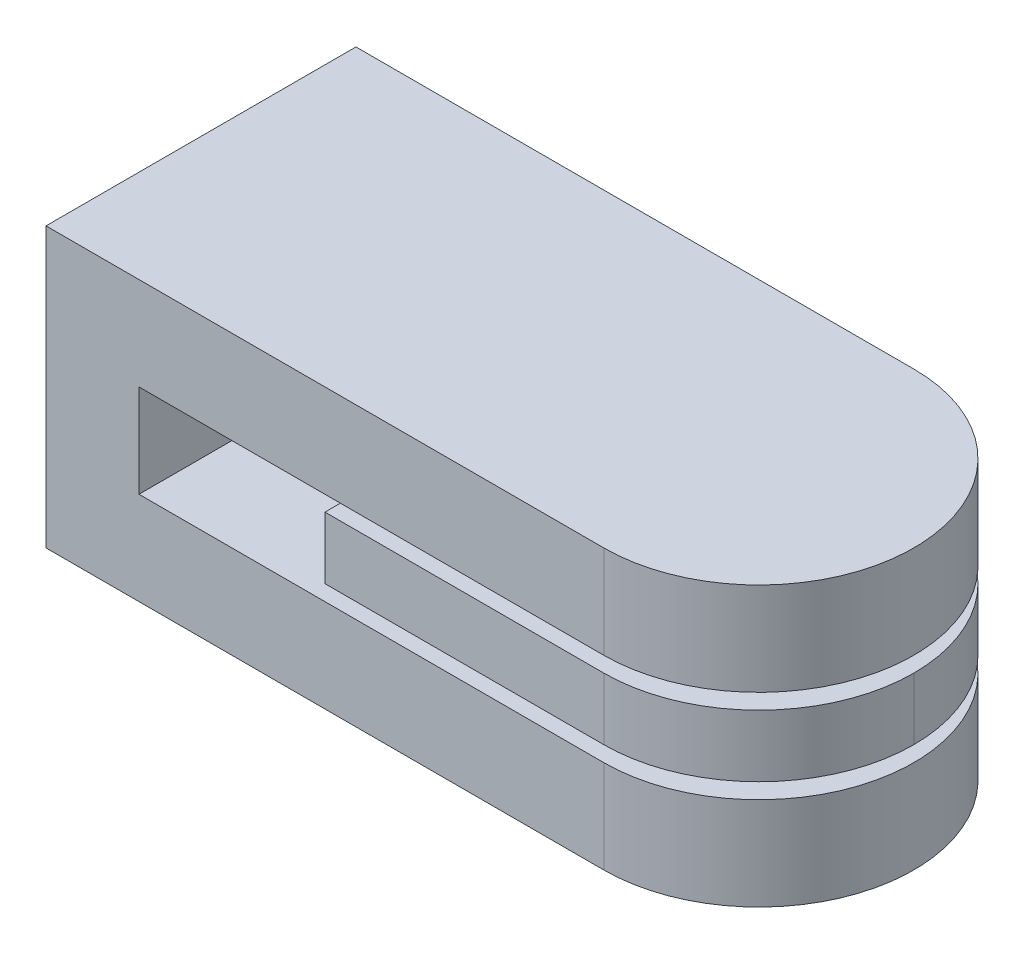
ISO-10303-21;
HEADER;
FILE_DESCRIPTION(('STEP AP214'),'2;1');
FILE_NAME('part.step','',(''),(''),'','','');
FILE_SCHEMA(('AUTOMOTIVE_DESIGN { 1 0 10303 214 1 1 1 1 }'));
ENDSEC;
DATA;
#1=APPLICATION_CONTEXT('core data for automotive mechanical design processes');
#2=APPLICATION_PROTOCOL_DEFINITION('international standard','automotive_design',2000,#1);
#3=PRODUCT_CONTEXT('',#1,'mechanical');
#4=PRODUCT('Part','Part','',(#3));
#5=PRODUCT_RELATED_PRODUCT_CATEGORY('part','',(#4));
#6=PRODUCT_DEFINITION_FORMATION('','',#4);
#7=PRODUCT_DEFINITION_CONTEXT('part definition',#1,'design');
#8=PRODUCT_DEFINITION('design','',#6,#7);
#9=PRODUCT_DEFINITION_SHAPE('','',#8);
#10=(LENGTH_UNIT() NAMED_UNIT(*) SI_UNIT(.MILLI.,.METRE.));
#11=(NAMED_UNIT(*) PLANE_ANGLE_UNIT() SI_UNIT($,.RADIAN.));
#12=(NAMED_UNIT(*) SI_UNIT($,.STERADIAN.) SOLID_ANGLE_UNIT());
#13=UNCERTAINTY_MEASURE_WITH_UNIT(LENGTH_MEASURE(1.E-05),#10,'distance_accuracy_value','');
#14=(GEOMETRIC_REPRESENTATION_CONTEXT(3) GLOBAL_UNCERTAINTY_ASSIGNED_CONTEXT((#13)) GLOBAL_UNIT_ASSIGNED_CONTEXT((#10,
#11,#12)) REPRESENTATION_CONTEXT('',''));
#15=CARTESIAN_POINT('',(0.,0.,0.));
#16=DIRECTION('',(0.,0.,1.));
#17=DIRECTION('',(1.,0.,0.));
#18=AXIS2_PLACEMENT_3D('',#15,#16,#17);
#19=CARTESIAN_POINT('',(0.,3.,0.));
#20=DIRECTION('',(0.,0.,-1.));
#21=DIRECTION('',(-1.,0.,0.));
#22=AXIS2_PLACEMENT_3D('',#19,#20,#21);
#23=PLANE('',#22);
#24=DIRECTION('',(1.,0.,0.));
#25=VECTOR('',#24,1.);
#26=CARTESIAN_POINT('',(0.,3.,0.));
#27=LINE('',#26,#25);
#28=CARTESIAN_POINT('',(0.,3.,0.));
#29=VERTEX_POINT('',#28);
#30=CARTESIAN_POINT('',(15.,3.,0.));
#31=VERTEX_POINT('',#30);
#32=EDGE_CURVE('E184',#29,#31,#27,.T.);
#33=ORIENTED_EDGE('',*,*,#32,.F.);
#34=DIRECTION('',(0.,1.,0.));
#35=VECTOR('',#34,1.);
#36=CARTESIAN_POINT('',(0.,0.,0.));
#37=LINE('',#36,#35);
#38=CARTESIAN_POINT('',(0.,6.,0.));
#39=VERTEX_POINT('',#38);
#40=EDGE_CURVE('E123',#29,#39,#37,.T.);
#41=ORIENTED_EDGE('',*,*,#40,.T.);
#42=DIRECTION('',(1.,0.,0.));
#43=VECTOR('',#42,1.);
#44=CARTESIAN_POINT('',(15.,6.,0.));
#45=LINE('',#44,#43);
#46=CARTESIAN_POINT('',(15.,6.,0.));
#47=VERTEX_POINT('',#46);
#48=EDGE_CURVE('E118',#39,#47,#45,.T.);
#49=ORIENTED_EDGE('',*,*,#48,.T.);
#50=DIRECTION('',(0.,-1.,0.));
#51=VECTOR('',#50,1.);
#52=CARTESIAN_POINT('',(15.,9.,0.));
#53=LINE('',#52,#51);
#54=CARTESIAN_POINT('',(15.,9.,0.));
#55=VERTEX_POINT('',#54);
#56=EDGE_CURVE('E121',#55,#47,#53,.T.);
#57=ORIENTED_EDGE('',*,*,#56,.F.);
#58=DIRECTION('',(1.,0.,0.));
#59=VECTOR('',#58,1.);
#60=CARTESIAN_POINT('',(15.,9.,0.));
#61=LINE('',#60,#59);
#62=CARTESIAN_POINT('',(-3.,9.,0.));
#63=VERTEX_POINT('',#62);
#64=EDGE_CURVE('E141',#63,#55,#61,.T.);
#65=ORIENTED_EDGE('',*,*,#64,.F.);
#66=DIRECTION('',(0.,1.,0.));
#67=VECTOR('',#66,1.);
#68=CARTESIAN_POINT('',(-3.,0.,0.));
#69=LINE('',#68,#67);
#70=CARTESIAN_POINT('',(-3.,0.,0.));
#71=VERTEX_POINT('',#70);
#72=EDGE_CURVE('E56',#71,#63,#69,.T.);
#73=ORIENTED_EDGE('',*,*,#72,.F.);
#74=DIRECTION('',(1.,0.,0.));
#75=VECTOR('',#74,1.);
#76=CARTESIAN_POINT('',(0.,0.,0.));
#77=LINE('',#76,#75);
#78=CARTESIAN_POINT('',(15.,0.,0.));
#79=VERTEX_POINT('',#78);
#80=EDGE_CURVE('E96',#71,#79,#77,.T.);
#81=ORIENTED_EDGE('',*,*,#80,.T.);
#82=DIRECTION('',(0.,-1.,0.));
#83=VECTOR('',#82,1.);
#84=CARTESIAN_POINT('',(15.,3.,0.));
#85=LINE('',#84,#83);
#86=EDGE_CURVE('E172',#31,#79,#85,.T.);
#87=ORIENTED_EDGE('',*,*,#86,.F.);
#88=EDGE_LOOP('',(#33,#41,#49,#57,#65,#73,#81,#87));
#89=FACE_BOUND('',#88,.T.);
#90=ADVANCED_FACE('F47',(#89),#23,.F.);
#91=CARTESIAN_POINT('',(0.,3.,-10.));
#92=DIRECTION('',(0.,0.,1.));
#93=DIRECTION('',(1.,0.,0.));
#94=AXIS2_PLACEMENT_3D('',#91,#92,#93);
#95=PLANE('',#94);
#96=DIRECTION('',(-1.,0.,0.));
#97=VECTOR('',#96,1.);
#98=CARTESIAN_POINT('',(15.,6.,-10.));
#99=LINE('',#98,#97);
#100=CARTESIAN_POINT('',(15.,6.,-10.));
#101=VERTEX_POINT('',#100);
#102=CARTESIAN_POINT('',(0.,6.,-10.));
#103=VERTEX_POINT('',#102);
#104=EDGE_CURVE('E65',#101,#103,#99,.T.);
#105=ORIENTED_EDGE('',*,*,#104,.T.);
#106=DIRECTION('',(0.,-1.,0.));
#107=VECTOR('',#106,1.);
#108=CARTESIAN_POINT('',(0.,0.,-10.));
#109=LINE('',#108,#107);
#110=CARTESIAN_POINT('',(0.,3.,-10.));
#111=VERTEX_POINT('',#110);
#112=EDGE_CURVE('E148',#103,#111,#109,.T.);
#113=ORIENTED_EDGE('',*,*,#112,.T.);
#114=DIRECTION('',(-1.,0.,0.));
#115=VECTOR('',#114,1.);
#116=CARTESIAN_POINT('',(0.,3.,-10.));
#117=LINE('',#116,#115);
#118=CARTESIAN_POINT('',(15.,3.,-10.));
#119=VERTEX_POINT('',#118);
#120=EDGE_CURVE('E135',#119,#111,#117,.T.);
#121=ORIENTED_EDGE('',*,*,#120,.F.);
#122=DIRECTION('',(0.,-1.,0.));
#123=VECTOR('',#122,1.);
#124=CARTESIAN_POINT('',(15.,3.,-10.));
#125=LINE('',#124,#123);
#126=CARTESIAN_POINT('',(15.,0.,-10.));
#127=VERTEX_POINT('',#126);
#128=EDGE_CURVE('E149',#119,#127,#125,.T.);
#129=ORIENTED_EDGE('',*,*,#128,.T.);
#130=DIRECTION('',(-1.,0.,0.));
#131=VECTOR('',#130,1.);
#132=CARTESIAN_POINT('',(0.,0.,-10.));
#133=LINE('',#132,#131);
#134=CARTESIAN_POINT('',(-3.,0.,-10.));
#135=VERTEX_POINT('',#134);
#136=EDGE_CURVE('E166',#127,#135,#133,.T.);
#137=ORIENTED_EDGE('',*,*,#136,.T.);
#138=DIRECTION('',(0.,-1.,0.));
#139=VECTOR('',#138,1.);
#140=CARTESIAN_POINT('',(-3.,0.,-10.));
#141=LINE('',#140,#139);
#142=CARTESIAN_POINT('',(-3.,9.,-10.));
#143=VERTEX_POINT('',#142);
#144=EDGE_CURVE('E50',#143,#135,#141,.T.);
#145=ORIENTED_EDGE('',*,*,#144,.F.);
#146=DIRECTION('',(-1.,0.,0.));
#147=VECTOR('',#146,1.);
#148=CARTESIAN_POINT('',(15.,9.,-10.));
#149=LINE('',#148,#147);
#150=CARTESIAN_POINT('',(15.,9.,-10.));
#151=VERTEX_POINT('',#150);
#152=EDGE_CURVE('E144',#151,#143,#149,.T.);
#153=ORIENTED_EDGE('',*,*,#152,.F.);
#154=DIRECTION('',(0.,-1.,0.));
#155=VECTOR('',#154,1.);
#156=CARTESIAN_POINT('',(15.,9.,-10.));
#157=LINE('',#156,#155);
#158=EDGE_CURVE('E165',#151,#101,#157,.T.);
#159=ORIENTED_EDGE('',*,*,#158,.T.);
#160=EDGE_LOOP('',(#105,#113,#121,#129,#137,#145,#153,#159));
#161=FACE_BOUND('',#160,.T.);
#162=ADVANCED_FACE('F178',(#161),#95,.F.);
#163=CARTESIAN_POINT('',(15.,6.,-5.));
#164=DIRECTION('',(0.,-1.,0.));
#165=DIRECTION('',(0.,0.,-1.));
#166=AXIS2_PLACEMENT_3D('',#163,#164,#165);
#167=CYLINDRICAL_SURFACE('',#166,1.5);
#168=CARTESIAN_POINT('',(15.,6.,-5.));
#169=DIRECTION('',(0.,1.,0.));
#170=DIRECTION('',(0.,0.,1.));
#171=AXIS2_PLACEMENT_3D('',#168,#169,#170);
#172=CIRCLE('',#171,1.5);
#173=CARTESIAN_POINT('',(15.,6.,-3.5));
#174=VERTEX_POINT('',#173);
#175=EDGE_CURVE('E143',#174,#174,#172,.T.);
#176=ORIENTED_EDGE('',*,*,#175,.F.);
#177=EDGE_LOOP('',(#176));
#178=FACE_BOUND('',#177,.T.);
#179=CARTESIAN_POINT('',(15.,3.,-5.));
#180=DIRECTION('',(0.,1.,0.));
#181=DIRECTION('',(0.,0.,1.));
#182=AXIS2_PLACEMENT_3D('',#179,#180,#181);
#183=CIRCLE('',#182,1.5);
#184=CARTESIAN_POINT('',(15.,3.,-3.5));
#185=VERTEX_POINT('',#184);
#186=EDGE_CURVE('E163',#185,#185,#183,.T.);
#187=ORIENTED_EDGE('',*,*,#186,.T.);
#188=EDGE_LOOP('',(#187));
#189=FACE_BOUND('',#188,.T.);
#190=ADVANCED_FACE('F208',(#178,#189),#167,.T.);
#191=CARTESIAN_POINT('',(0.,0.,0.));
#192=DIRECTION('',(1.,0.,0.));
#193=DIRECTION('',(0.,0.,-1.));
#194=AXIS2_PLACEMENT_3D('',#191,#192,#193);
#195=PLANE('',#194);
#196=ORIENTED_EDGE('',*,*,#112,.F.);
#197=DIRECTION('',(0.,0.,1.));
#198=VECTOR('',#197,1.);
#199=CARTESIAN_POINT('',(0.,6.,0.));
#200=LINE('',#199,#198);
#201=EDGE_CURVE('E167',#103,#39,#200,.T.);
#202=ORIENTED_EDGE('',*,*,#201,.T.);
#203=ORIENTED_EDGE('',*,*,#40,.F.);
#204=DIRECTION('',(0.,0.,1.));
#205=VECTOR('',#204,1.);
#206=CARTESIAN_POINT('',(0.,3.,0.));
#207=LINE('',#206,#205);
#208=EDGE_CURVE('E183',#111,#29,#207,.T.);
#209=ORIENTED_EDGE('',*,*,#208,.F.);
#210=EDGE_LOOP('',(#196,#202,#203,#209));
#211=FACE_BOUND('',#210,.T.);
#212=ADVANCED_FACE('F181',(#211),#195,.T.);
#213=CARTESIAN_POINT('',(15.,3.,-5.));
#214=DIRECTION('',(0.,-1.,0.));
#215=DIRECTION('',(0.,0.,-1.));
#216=AXIS2_PLACEMENT_3D('',#213,#214,#215);
#217=CYLINDRICAL_SURFACE('',#216,5.);
#218=CARTESIAN_POINT('',(15.,0.,-5.));
#219=DIRECTION('',(0.,1.,0.));
#220=DIRECTION('',(0.,0.,1.));
#221=AXIS2_PLACEMENT_3D('',#218,#219,#220);
#222=CIRCLE('',#221,5.);
#223=EDGE_CURVE('E168',#79,#127,#222,.T.);
#224=ORIENTED_EDGE('',*,*,#223,.T.);
#225=ORIENTED_EDGE('',*,*,#128,.F.);
#226=CARTESIAN_POINT('',(15.,3.,-5.));
#227=DIRECTION('',(0.,1.,0.));
#228=DIRECTION('',(0.,0.,1.));
#229=AXIS2_PLACEMENT_3D('',#226,#227,#228);
#230=CIRCLE('',#229,5.);
#231=EDGE_CURVE('E105',#31,#119,#230,.T.);
#232=ORIENTED_EDGE('',*,*,#231,.F.);
#233=ORIENTED_EDGE('',*,*,#86,.T.);
#234=EDGE_LOOP('',(#224,#225,#232,#233));
#235=FACE_BOUND('',#234,.T.);
#236=ADVANCED_FACE('F199',(#235),#217,.T.);
#237=CARTESIAN_POINT('',(15.,3.,-5.));
#238=DIRECTION('',(0.,1.,0.));
#239=DIRECTION('',(0.,0.,1.));
#240=AXIS2_PLACEMENT_3D('',#237,#238,#239);
#241=PLANE('',#240);
#242=ORIENTED_EDGE('',*,*,#186,.F.);
#243=EDGE_LOOP('',(#242));
#244=FACE_BOUND('',#243,.T.);
#245=ORIENTED_EDGE('',*,*,#208,.T.);
#246=ORIENTED_EDGE('',*,*,#32,.T.);
#247=ORIENTED_EDGE('',*,*,#231,.T.);
#248=ORIENTED_EDGE('',*,*,#120,.T.);
#249=EDGE_LOOP('',(#245,#246,#247,#248));
#250=FACE_BOUND('',#249,.T.);
#251=ADVANCED_FACE('F185',(#244,#250),#241,.T.);
#252=CARTESIAN_POINT('',(15.,0.,-5.));
#253=DIRECTION('',(0.,1.,0.));
#254=DIRECTION('',(0.,0.,1.));
#255=AXIS2_PLACEMENT_3D('',#252,#253,#254);
#256=PLANE('',#255);
#257=ORIENTED_EDGE('',*,*,#80,.F.);
#258=DIRECTION('',(0.,0.,1.));
#259=VECTOR('',#258,1.);
#260=CARTESIAN_POINT('',(-3.,0.,-10.));
#261=LINE('',#260,#259);
#262=EDGE_CURVE('E152',#135,#71,#261,.T.);
#263=ORIENTED_EDGE('',*,*,#262,.F.);
#264=ORIENTED_EDGE('',*,*,#136,.F.);
#265=ORIENTED_EDGE('',*,*,#223,.F.);
#266=EDGE_LOOP('',(#257,#263,#264,#265));
#267=FACE_BOUND('',#266,.T.);
#268=ADVANCED_FACE('F191',(#267),#256,.F.);
#269=CARTESIAN_POINT('',(15.,9.,-5.));
#270=DIRECTION('',(0.,-1.,0.));
#271=DIRECTION('',(0.,0.,-1.));
#272=AXIS2_PLACEMENT_3D('',#269,#270,#271);
#273=CYLINDRICAL_SURFACE('',#272,5.);
#274=CARTESIAN_POINT('',(15.,6.,-5.));
#275=DIRECTION('',(0.,1.,0.));
#276=DIRECTION('',(0.,0.,1.));
#277=AXIS2_PLACEMENT_3D('',#274,#275,#276);
#278=CIRCLE('',#277,5.);
#279=EDGE_CURVE('E130',#47,#101,#278,.T.);
#280=ORIENTED_EDGE('',*,*,#279,.T.);
#281=ORIENTED_EDGE('',*,*,#158,.F.);
#282=CARTESIAN_POINT('',(15.,9.,-5.));
#283=DIRECTION('',(0.,1.,0.));
#284=DIRECTION('',(0.,0.,1.));
#285=AXIS2_PLACEMENT_3D('',#282,#283,#284);
#286=CIRCLE('',#285,5.);
#287=EDGE_CURVE('E132',#55,#151,#286,.T.);
#288=ORIENTED_EDGE('',*,*,#287,.F.);
#289=ORIENTED_EDGE('',*,*,#56,.T.);
#290=EDGE_LOOP('',(#280,#281,#288,#289));
#291=FACE_BOUND('',#290,.T.);
#292=ADVANCED_FACE('F128',(#291),#273,.T.);
#293=CARTESIAN_POINT('',(15.,9.,-5.));
#294=DIRECTION('',(0.,1.,0.));
#295=DIRECTION('',(0.,0.,1.));
#296=AXIS2_PLACEMENT_3D('',#293,#294,#295);
#297=PLANE('',#296);
#298=ORIENTED_EDGE('',*,*,#287,.T.);
#299=ORIENTED_EDGE('',*,*,#152,.T.);
#300=DIRECTION('',(0.,0.,-1.));
#301=VECTOR('',#300,1.);
#302=CARTESIAN_POINT('',(-3.,9.,-10.));
#303=LINE('',#302,#301);
#304=EDGE_CURVE('E12',#63,#143,#303,.T.);
#305=ORIENTED_EDGE('',*,*,#304,.F.);
#306=ORIENTED_EDGE('',*,*,#64,.T.);
#307=EDGE_LOOP('',(#298,#299,#305,#306));
#308=FACE_BOUND('',#307,.T.);
#309=ADVANCED_FACE('F224',(#308),#297,.T.);
#310=CARTESIAN_POINT('',(15.,6.,-5.));
#311=DIRECTION('',(0.,1.,0.));
#312=DIRECTION('',(0.,0.,1.));
#313=AXIS2_PLACEMENT_3D('',#310,#311,#312);
#314=PLANE('',#313);
#315=ORIENTED_EDGE('',*,*,#175,.T.);
#316=EDGE_LOOP('',(#315));
#317=FACE_BOUND('',#316,.T.);
#318=ORIENTED_EDGE('',*,*,#279,.F.);
#319=ORIENTED_EDGE('',*,*,#48,.F.);
#320=ORIENTED_EDGE('',*,*,#201,.F.);
#321=ORIENTED_EDGE('',*,*,#104,.F.);
#322=EDGE_LOOP('',(#318,#319,#320,#321));
#323=FACE_BOUND('',#322,.T.);
#324=ADVANCED_FACE('F134',(#317,#323),#314,.F.);
#325=CARTESIAN_POINT('',(-3.,0.,0.));
#326=DIRECTION('',(1.,0.,0.));
#327=DIRECTION('',(0.,0.,-1.));
#328=AXIS2_PLACEMENT_3D('',#325,#326,#327);
#329=PLANE('',#328);
#330=ORIENTED_EDGE('',*,*,#144,.T.);
#331=ORIENTED_EDGE('',*,*,#262,.T.);
#332=ORIENTED_EDGE('',*,*,#72,.T.);
#333=ORIENTED_EDGE('',*,*,#304,.T.);
#334=EDGE_LOOP('',(#330,#331,#332,#333));
#335=FACE_BOUND('',#334,.T.);
#336=ADVANCED_FACE('F221',(#335),#329,.F.);
#337=CLOSED_SHELL('',(#90,#162,#190,#212,#236,#251,#268,#292,#309,#324,#336));
#338=MANIFOLD_SOLID_BREP('B2',#337);
#339=CARTESIAN_POINT('',(15.,0.,-5.));
#340=DIRECTION('',(0.,-1.,0.));
#341=DIRECTION('',(0.,0.,-1.));
#342=AXIS2_PLACEMENT_3D('',#339,#340,#341);
#343=CYLINDRICAL_SURFACE('',#342,5.);
#344=CARTESIAN_POINT('',(15.,3.50230871686685,-5.));
#345=DIRECTION('',(0.,1.,0.));
#346=DIRECTION('',(0.,0.,1.));
#347=AXIS2_PLACEMENT_3D('',#344,#345,#346);
#348=CIRCLE('',#347,5.);
#349=CARTESIAN_POINT('',(15.,3.50230871686685,-10.));
#350=VERTEX_POINT('',#349);
#351=CARTESIAN_POINT('',(20.,3.50230871686685,-5.));
#352=VERTEX_POINT('',#351);
#353=EDGE_CURVE('E45',#350,#352,#348,.F.);
#354=ORIENTED_EDGE('',*,*,#353,.F.);
#355=DIRECTION('',(0.,1.,0.));
#356=VECTOR('',#355,1.);
#357=CARTESIAN_POINT('',(15.,3.50230871686685,-10.));
#358=LINE('',#357,#356);
#359=CARTESIAN_POINT('',(15.,5.50230871686685,-10.));
#360=VERTEX_POINT('',#359);
#361=EDGE_CURVE('E333',#360,#350,#358,.F.);
#362=ORIENTED_EDGE('',*,*,#361,.F.);
#363=CARTESIAN_POINT('',(15.,5.50230871686685,-5.));
#364=DIRECTION('',(0.,-1.,0.));
#365=DIRECTION('',(0.,0.,-1.));
#366=AXIS2_PLACEMENT_3D('',#363,#364,#365);
#367=CIRCLE('',#366,5.);
#368=CARTESIAN_POINT('',(20.,5.50230871686685,-5.));
#369=VERTEX_POINT('',#368);
#370=EDGE_CURVE('E385',#369,#360,#367,.F.);
#371=ORIENTED_EDGE('',*,*,#370,.F.);
#372=DIRECTION('',(0.,-1.,0.));
#373=VECTOR('',#372,1.);
#374=CARTESIAN_POINT('',(20.,3.50230871686685,-5.));
#375=LINE('',#374,#373);
#376=EDGE_CURVE('E396',#369,#352,#375,.T.);
#377=ORIENTED_EDGE('',*,*,#376,.T.);
#378=EDGE_LOOP('',(#354,#362,#371,#377));
#379=FACE_BOUND('',#378,.T.);
#380=ADVANCED_FACE('F326',(#379),#343,.T.);
#381=CARTESIAN_POINT('',(15.,0.,-5.));
#382=DIRECTION('',(0.,1.,0.));
#383=DIRECTION('',(0.,0.,1.));
#384=AXIS2_PLACEMENT_3D('',#381,#382,#383);
#385=CYLINDRICAL_SURFACE('',#384,5.);
#386=CARTESIAN_POINT('',(15.,5.50230871686685,-5.));
#387=DIRECTION('',(0.,-1.,0.));
#388=DIRECTION('',(0.,0.,-1.));
#389=AXIS2_PLACEMENT_3D('',#386,#387,#388);
#390=CIRCLE('',#389,5.);
#391=CARTESIAN_POINT('',(15.,5.50230871686685,0.));
#392=VERTEX_POINT('',#391);
#393=EDGE_CURVE('E403',#392,#369,#390,.F.);
#394=ORIENTED_EDGE('',*,*,#393,.F.);
#395=DIRECTION('',(0.,-1.,0.));
#396=VECTOR('',#395,1.);
#397=CARTESIAN_POINT('',(15.,5.50230871686685,0.));
#398=LINE('',#397,#396);
#399=CARTESIAN_POINT('',(15.,3.50230871686685,0.));
#400=VERTEX_POINT('',#399);
#401=EDGE_CURVE('E401',#400,#392,#398,.F.);
#402=ORIENTED_EDGE('',*,*,#401,.F.);
#403=CARTESIAN_POINT('',(15.,3.50230871686685,-5.));
#404=DIRECTION('',(0.,1.,0.));
#405=DIRECTION('',(0.,0.,1.));
#406=AXIS2_PLACEMENT_3D('',#403,#404,#405);
#407=CIRCLE('',#406,5.);
#408=EDGE_CURVE('E399',#352,#400,#407,.F.);
#409=ORIENTED_EDGE('',*,*,#408,.F.);
#410=ORIENTED_EDGE('',*,*,#376,.F.);
#411=EDGE_LOOP('',(#394,#402,#409,#410));
#412=FACE_BOUND('',#411,.T.);
#413=ADVANCED_FACE('F410',(#412),#385,.T.);
#414=CARTESIAN_POINT('',(15.,3.30230871686685,-5.));
#415=DIRECTION('',(0.,1.,0.));
#416=DIRECTION('',(0.,0.,1.));
#417=AXIS2_PLACEMENT_3D('',#414,#415,#416);
#418=CYLINDRICAL_SURFACE('',#417,1.8);
#419=CARTESIAN_POINT('',(15.,5.50230871686685,-5.));
#420=DIRECTION('',(0.,1.,0.));
#421=DIRECTION('',(0.,0.,1.));
#422=AXIS2_PLACEMENT_3D('',#419,#420,#421);
#423=CIRCLE('',#422,1.8);
#424=CARTESIAN_POINT('',(15.,5.50230871686685,-3.2));
#425=VERTEX_POINT('',#424);
#426=EDGE_CURVE('E417',#425,#425,#423,.T.);
#427=ORIENTED_EDGE('',*,*,#426,.T.);
#428=EDGE_LOOP('',(#427));
#429=FACE_BOUND('',#428,.T.);
#430=CARTESIAN_POINT('',(15.,3.50230871686685,-5.));
#431=DIRECTION('',(0.,1.,0.));
#432=DIRECTION('',(0.,0.,1.));
#433=AXIS2_PLACEMENT_3D('',#430,#431,#432);
#434=CIRCLE('',#433,1.8);
#435=CARTESIAN_POINT('',(15.,3.50230871686685,-3.2));
#436=VERTEX_POINT('',#435);
#437=EDGE_CURVE('E390',#436,#436,#434,.T.);
#438=ORIENTED_EDGE('',*,*,#437,.F.);
#439=EDGE_LOOP('',(#438));
#440=FACE_BOUND('',#439,.T.);
#441=ADVANCED_FACE('F426',(#429,#440),#418,.F.);
#442=CARTESIAN_POINT('',(20.,5.50230871686685,-10.));
#443=DIRECTION('',(0.,-1.,0.));
#444=DIRECTION('',(0.,0.,-1.));
#445=AXIS2_PLACEMENT_3D('',#442,#443,#444);
#446=PLANE('',#445);
#447=ORIENTED_EDGE('',*,*,#426,.F.);
#448=EDGE_LOOP('',(#447));
#449=FACE_BOUND('',#448,.T.);
#450=DIRECTION('',(-1.,0.,0.));
#451=VECTOR('',#450,1.);
#452=CARTESIAN_POINT('',(20.,5.50230871686685,-10.));
#453=LINE('',#452,#451);
#454=CARTESIAN_POINT('',(6.,5.50230871686685,-10.));
#455=VERTEX_POINT('',#454);
#456=EDGE_CURVE('E380',#360,#455,#453,.T.);
#457=ORIENTED_EDGE('',*,*,#456,.T.);
#458=DIRECTION('',(0.,0.,1.));
#459=VECTOR('',#458,1.);
#460=CARTESIAN_POINT('',(6.,5.50230871686685,-10.));
#461=LINE('',#460,#459);
#462=CARTESIAN_POINT('',(6.,5.50230871686685,0.));
#463=VERTEX_POINT('',#462);
#464=EDGE_CURVE('E369',#455,#463,#461,.T.);
#465=ORIENTED_EDGE('',*,*,#464,.T.);
#466=DIRECTION('',(-1.,0.,0.));
#467=VECTOR('',#466,1.);
#468=CARTESIAN_POINT('',(20.,5.50230871686685,0.));
#469=LINE('',#468,#467);
#470=EDGE_CURVE('E386',#392,#463,#469,.T.);
#471=ORIENTED_EDGE('',*,*,#470,.F.);
#472=ORIENTED_EDGE('',*,*,#393,.T.);
#473=ORIENTED_EDGE('',*,*,#370,.T.);
#474=EDGE_LOOP('',(#457,#465,#471,#472,#473));
#475=FACE_BOUND('',#474,.T.);
#476=ADVANCED_FACE('F383',(#449,#475),#446,.F.);
#477=CARTESIAN_POINT('',(20.,3.50230871686685,0.));
#478=DIRECTION('',(0.,1.,0.));
#479=DIRECTION('',(0.,0.,1.));
#480=AXIS2_PLACEMENT_3D('',#477,#478,#479);
#481=PLANE('',#480);
#482=ORIENTED_EDGE('',*,*,#437,.T.);
#483=EDGE_LOOP('',(#482));
#484=FACE_BOUND('',#483,.T.);
#485=DIRECTION('',(-1.,0.,0.));
#486=VECTOR('',#485,1.);
#487=CARTESIAN_POINT('',(20.,3.50230871686685,0.));
#488=LINE('',#487,#486);
#489=CARTESIAN_POINT('',(6.,3.50230871686685,0.));
#490=VERTEX_POINT('',#489);
#491=EDGE_CURVE('E388',#400,#490,#488,.T.);
#492=ORIENTED_EDGE('',*,*,#491,.T.);
#493=DIRECTION('',(0.,0.,-1.));
#494=VECTOR('',#493,1.);
#495=CARTESIAN_POINT('',(6.,3.50230871686685,-10.));
#496=LINE('',#495,#494);
#497=CARTESIAN_POINT('',(6.,3.50230871686685,-10.));
#498=VERTEX_POINT('',#497);
#499=EDGE_CURVE('E416',#490,#498,#496,.T.);
#500=ORIENTED_EDGE('',*,*,#499,.T.);
#501=DIRECTION('',(-1.,0.,0.));
#502=VECTOR('',#501,1.);
#503=CARTESIAN_POINT('',(20.,3.50230871686685,-10.));
#504=LINE('',#503,#502);
#505=EDGE_CURVE('E381',#350,#498,#504,.T.);
#506=ORIENTED_EDGE('',*,*,#505,.F.);
#507=ORIENTED_EDGE('',*,*,#353,.T.);
#508=ORIENTED_EDGE('',*,*,#408,.T.);
#509=EDGE_LOOP('',(#492,#500,#506,#507,#508));
#510=FACE_BOUND('',#509,.T.);
#511=ADVANCED_FACE('F414',(#484,#510),#481,.F.);
#512=CARTESIAN_POINT('',(0.,3.,-10.));
#513=DIRECTION('',(0.,0.,1.));
#514=DIRECTION('',(1.,0.,0.));
#515=AXIS2_PLACEMENT_3D('',#512,#513,#514);
#516=PLANE('',#515);
#517=ORIENTED_EDGE('',*,*,#505,.T.);
#518=DIRECTION('',(0.,1.,0.));
#519=VECTOR('',#518,1.);
#520=CARTESIAN_POINT('',(6.,3.50230871686685,-10.));
#521=LINE('',#520,#519);
#522=EDGE_CURVE('E372',#498,#455,#521,.T.);
#523=ORIENTED_EDGE('',*,*,#522,.T.);
#524=ORIENTED_EDGE('',*,*,#456,.F.);
#525=ORIENTED_EDGE('',*,*,#361,.T.);
#526=EDGE_LOOP('',(#517,#523,#524,#525));
#527=FACE_BOUND('',#526,.T.);
#528=ADVANCED_FACE('F379',(#527),#516,.F.);
#529=CARTESIAN_POINT('',(0.,3.,0.));
#530=DIRECTION('',(0.,0.,-1.));
#531=DIRECTION('',(-1.,0.,0.));
#532=AXIS2_PLACEMENT_3D('',#529,#530,#531);
#533=PLANE('',#532);
#534=ORIENTED_EDGE('',*,*,#470,.T.);
#535=DIRECTION('',(0.,-1.,0.));
#536=VECTOR('',#535,1.);
#537=CARTESIAN_POINT('',(6.,3.50230871686685,0.));
#538=LINE('',#537,#536);
#539=EDGE_CURVE('E340',#463,#490,#538,.T.);
#540=ORIENTED_EDGE('',*,*,#539,.T.);
#541=ORIENTED_EDGE('',*,*,#491,.F.);
#542=ORIENTED_EDGE('',*,*,#401,.T.);
#543=EDGE_LOOP('',(#534,#540,#541,#542));
#544=FACE_BOUND('',#543,.T.);
#545=ADVANCED_FACE('F464',(#544),#533,.F.);
#546=CARTESIAN_POINT('',(6.,0.,0.));
#547=DIRECTION('',(1.,0.,0.));
#548=DIRECTION('',(0.,0.,-1.));
#549=AXIS2_PLACEMENT_3D('',#546,#547,#548);
#550=PLANE('',#549);
#551=ORIENTED_EDGE('',*,*,#522,.F.);
#552=ORIENTED_EDGE('',*,*,#499,.F.);
#553=ORIENTED_EDGE('',*,*,#539,.F.);
#554=ORIENTED_EDGE('',*,*,#464,.F.);
#555=EDGE_LOOP('',(#551,#552,#553,#554));
#556=FACE_BOUND('',#555,.T.);
#557=ADVANCED_FACE('F371',(#556),#550,.F.);
#558=CLOSED_SHELL('',(#380,#413,#441,#476,#511,#528,#545,#557));
#559=MANIFOLD_SOLID_BREP('B6',#558);
#560=ADVANCED_BREP_SHAPE_REPRESENTATION('',(#18,#338,#559),#14);
#561=SHAPE_DEFINITION_REPRESENTATION(#9,#560);
ENDSEC;
END-ISO-10303-21;
